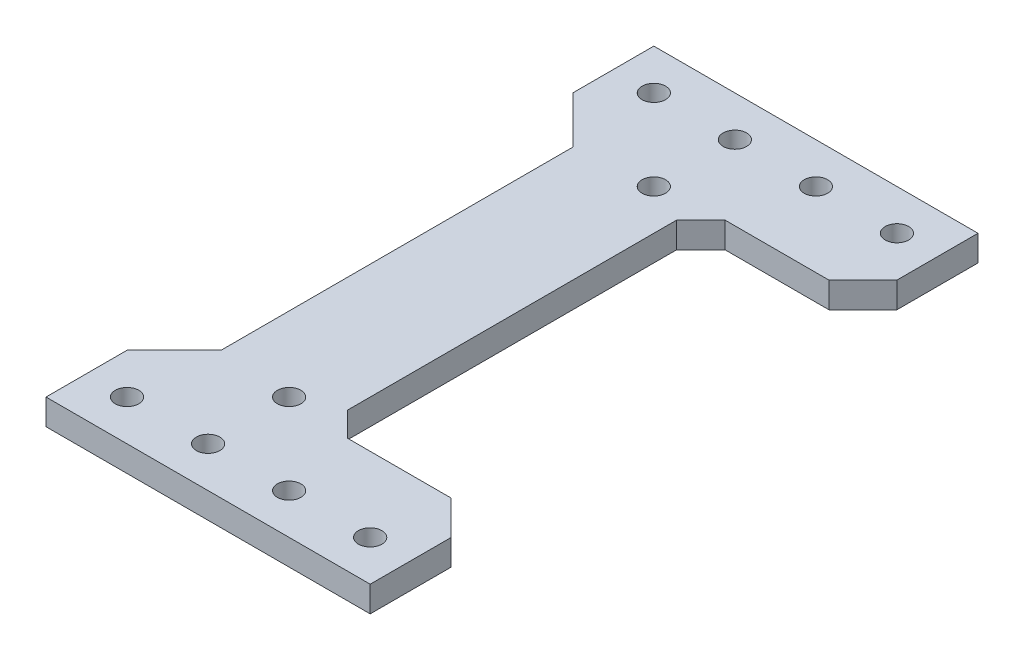
ISO-10303-21;
HEADER;
FILE_DESCRIPTION(('STEP AP214'),'2;1');
FILE_NAME('part.step','',(''),(''),'','','');
FILE_SCHEMA(('AUTOMOTIVE_DESIGN { 1 0 10303 214 1 1 1 1 }'));
ENDSEC;
DATA;
#1=APPLICATION_CONTEXT('core data for automotive mechanical design processes');
#2=APPLICATION_PROTOCOL_DEFINITION('international standard','automotive_design',2000,#1);
#3=PRODUCT_CONTEXT('',#1,'mechanical');
#4=PRODUCT('Part','Part','',(#3));
#5=PRODUCT_RELATED_PRODUCT_CATEGORY('part','',(#4));
#6=PRODUCT_DEFINITION_FORMATION('','',#4);
#7=PRODUCT_DEFINITION_CONTEXT('part definition',#1,'design');
#8=PRODUCT_DEFINITION('design','',#6,#7);
#9=PRODUCT_DEFINITION_SHAPE('','',#8);
#10=(LENGTH_UNIT() NAMED_UNIT(*) SI_UNIT(.MILLI.,.METRE.));
#11=(NAMED_UNIT(*) PLANE_ANGLE_UNIT() SI_UNIT($,.RADIAN.));
#12=(NAMED_UNIT(*) SI_UNIT($,.STERADIAN.) SOLID_ANGLE_UNIT());
#13=UNCERTAINTY_MEASURE_WITH_UNIT(LENGTH_MEASURE(1.E-05),#10,'distance_accuracy_value','');
#14=(GEOMETRIC_REPRESENTATION_CONTEXT(3) GLOBAL_UNCERTAINTY_ASSIGNED_CONTEXT((#13)) GLOBAL_UNIT_ASSIGNED_CONTEXT((#10,
#11,#12)) REPRESENTATION_CONTEXT('',''));
#15=CARTESIAN_POINT('',(0.,0.,0.));
#16=DIRECTION('',(0.,0.,1.));
#17=DIRECTION('',(1.,0.,0.));
#18=AXIS2_PLACEMENT_3D('',#15,#16,#17);
#19=CARTESIAN_POINT('',(5.,3.175,-23.3));
#20=DIRECTION('',(0.,-1.,0.));
#21=DIRECTION('',(0.,0.,-1.));
#22=AXIS2_PLACEMENT_3D('',#19,#20,#21);
#23=PLANE('',#22);
#24=CARTESIAN_POINT('',(0.,3.175,-32.5));
#25=DIRECTION('',(0.,1.,0.));
#26=DIRECTION('',(0.,0.,1.));
#27=AXIS2_PLACEMENT_3D('',#24,#25,#26);
#28=CIRCLE('',#27,1.45);
#29=CARTESIAN_POINT('',(0.,3.175,-31.05));
#30=VERTEX_POINT('',#29);
#31=EDGE_CURVE('E208',#30,#30,#28,.T.);
#32=ORIENTED_EDGE('',*,*,#31,.F.);
#33=EDGE_LOOP('',(#32));
#34=FACE_BOUND('',#33,.T.);
#35=CARTESIAN_POINT('',(-10.,3.175,-32.5));
#36=DIRECTION('',(0.,1.,0.));
#37=DIRECTION('',(0.,0.,1.));
#38=AXIS2_PLACEMENT_3D('',#35,#36,#37);
#39=CIRCLE('',#38,1.45);
#40=CARTESIAN_POINT('',(-10.,3.175,-31.05));
#41=VERTEX_POINT('',#40);
#42=EDGE_CURVE('E220',#41,#41,#39,.T.);
#43=ORIENTED_EDGE('',*,*,#42,.F.);
#44=EDGE_LOOP('',(#43));
#45=FACE_BOUND('',#44,.T.);
#46=DIRECTION('',(0.,0.,1.));
#47=VECTOR('',#46,1.);
#48=CARTESIAN_POINT('',(25.,3.175,37.5));
#49=LINE('',#48,#47);
#50=CARTESIAN_POINT('',(25.,3.175,27.5));
#51=VERTEX_POINT('',#50);
#52=CARTESIAN_POINT('',(25.,3.175,37.5));
#53=VERTEX_POINT('',#52);
#54=EDGE_CURVE('E182',#51,#53,#49,.T.);
#55=ORIENTED_EDGE('',*,*,#54,.F.);
#56=DIRECTION('',(0.707106781186547,0.,0.707106781186548));
#57=VECTOR('',#56,1.);
#58=CARTESIAN_POINT('',(20.8,3.175,23.3));
#59=LINE('',#58,#57);
#60=CARTESIAN_POINT('',(20.8,3.175,23.3));
#61=VERTEX_POINT('',#60);
#62=EDGE_CURVE('E279',#51,#61,#59,.F.);
#63=ORIENTED_EDGE('',*,*,#62,.T.);
#64=DIRECTION('',(1.,0.,0.));
#65=VECTOR('',#64,1.);
#66=CARTESIAN_POINT('',(5.00000000000001,3.175,23.3));
#67=LINE('',#66,#65);
#68=CARTESIAN_POINT('',(8.,3.175,23.3));
#69=VERTEX_POINT('',#68);
#70=EDGE_CURVE('E184',#69,#61,#67,.T.);
#71=ORIENTED_EDGE('',*,*,#70,.F.);
#72=DIRECTION('',(-0.707106781186544,0.,-0.707106781186551));
#73=VECTOR('',#72,1.);
#74=CARTESIAN_POINT('',(-16.8,3.175,-1.50000000000021));
#75=LINE('',#74,#73);
#76=CARTESIAN_POINT('',(5.,3.175,20.3));
#77=VERTEX_POINT('',#76);
#78=EDGE_CURVE('E11',#69,#77,#75,.T.);
#79=ORIENTED_EDGE('',*,*,#78,.T.);
#80=DIRECTION('',(0.,0.,-1.));
#81=VECTOR('',#80,1.);
#82=CARTESIAN_POINT('',(5.,3.175,0.));
#83=LINE('',#82,#81);
#84=CARTESIAN_POINT('',(5.,3.175,-20.3));
#85=VERTEX_POINT('',#84);
#86=EDGE_CURVE('E232',#77,#85,#83,.T.);
#87=ORIENTED_EDGE('',*,*,#86,.T.);
#88=DIRECTION('',(-0.707106781186552,0.,0.707106781186543));
#89=VECTOR('',#88,1.);
#90=CARTESIAN_POINT('',(6.49999999999999,3.175,-21.8));
#91=LINE('',#90,#89);
#92=CARTESIAN_POINT('',(8.00000000000002,3.175,-23.3));
#93=VERTEX_POINT('',#92);
#94=EDGE_CURVE('E299',#85,#93,#91,.F.);
#95=ORIENTED_EDGE('',*,*,#94,.T.);
#96=DIRECTION('',(1.,0.,0.));
#97=VECTOR('',#96,1.);
#98=CARTESIAN_POINT('',(5.,3.175,-23.3));
#99=LINE('',#98,#97);
#100=CARTESIAN_POINT('',(20.8,3.175,-23.3));
#101=VERTEX_POINT('',#100);
#102=EDGE_CURVE('E235',#93,#101,#99,.T.);
#103=ORIENTED_EDGE('',*,*,#102,.T.);
#104=DIRECTION('',(-0.707106781186549,0.,0.707106781186546));
#105=VECTOR('',#104,1.);
#106=CARTESIAN_POINT('',(25.,3.175,-27.5));
#107=LINE('',#106,#105);
#108=CARTESIAN_POINT('',(25.,3.175,-27.5));
#109=VERTEX_POINT('',#108);
#110=EDGE_CURVE('E277',#101,#109,#107,.F.);
#111=ORIENTED_EDGE('',*,*,#110,.T.);
#112=DIRECTION('',(0.,0.,-1.));
#113=VECTOR('',#112,1.);
#114=CARTESIAN_POINT('',(25.,3.175,-37.5));
#115=LINE('',#114,#113);
#116=CARTESIAN_POINT('',(25.,3.175,-37.5));
#117=VERTEX_POINT('',#116);
#118=EDGE_CURVE('E237',#109,#117,#115,.T.);
#119=ORIENTED_EDGE('',*,*,#118,.T.);
#120=DIRECTION('',(-1.,0.,0.));
#121=VECTOR('',#120,1.);
#122=CARTESIAN_POINT('',(-15.,3.175,-37.5));
#123=LINE('',#122,#121);
#124=CARTESIAN_POINT('',(-15.,3.175,-37.5));
#125=VERTEX_POINT('',#124);
#126=EDGE_CURVE('E239',#117,#125,#123,.T.);
#127=ORIENTED_EDGE('',*,*,#126,.T.);
#128=DIRECTION('',(0.,0.,1.));
#129=VECTOR('',#128,1.);
#130=CARTESIAN_POINT('',(-15.,3.175,-37.5));
#131=LINE('',#130,#129);
#132=CARTESIAN_POINT('',(-15.,3.175,-27.5));
#133=VERTEX_POINT('',#132);
#134=EDGE_CURVE('E241',#125,#133,#131,.T.);
#135=ORIENTED_EDGE('',*,*,#134,.T.);
#136=DIRECTION('',(0.707106781186549,0.,0.707106781186546));
#137=VECTOR('',#136,1.);
#138=CARTESIAN_POINT('',(-15.,3.175,-27.5));
#139=LINE('',#138,#137);
#140=CARTESIAN_POINT('',(-9.2,3.175,-21.7));
#141=VERTEX_POINT('',#140);
#142=EDGE_CURVE('E151',#133,#141,#139,.T.);
#143=ORIENTED_EDGE('',*,*,#142,.T.);
#144=DIRECTION('',(0.,0.,1.));
#145=VECTOR('',#144,1.);
#146=CARTESIAN_POINT('',(-9.2,3.175,0.));
#147=LINE('',#146,#145);
#148=CARTESIAN_POINT('',(-9.19999999999999,3.175,21.7));
#149=VERTEX_POINT('',#148);
#150=EDGE_CURVE('E142',#141,#149,#147,.T.);
#151=ORIENTED_EDGE('',*,*,#150,.T.);
#152=DIRECTION('',(0.707106781186549,0.,-0.707106781186546));
#153=VECTOR('',#152,1.);
#154=CARTESIAN_POINT('',(-15.,3.175,27.5));
#155=LINE('',#154,#153);
#156=CARTESIAN_POINT('',(-15.,3.175,27.5));
#157=VERTEX_POINT('',#156);
#158=EDGE_CURVE('E148',#157,#149,#155,.T.);
#159=ORIENTED_EDGE('',*,*,#158,.F.);
#160=DIRECTION('',(0.,0.,-1.));
#161=VECTOR('',#160,1.);
#162=CARTESIAN_POINT('',(-15.,3.175,37.5));
#163=LINE('',#162,#161);
#164=CARTESIAN_POINT('',(-15.,3.175,37.5));
#165=VERTEX_POINT('',#164);
#166=EDGE_CURVE('E169',#165,#157,#163,.T.);
#167=ORIENTED_EDGE('',*,*,#166,.F.);
#168=DIRECTION('',(-1.,0.,0.));
#169=VECTOR('',#168,1.);
#170=CARTESIAN_POINT('',(-15.,3.175,37.5));
#171=LINE('',#170,#169);
#172=EDGE_CURVE('E172',#53,#165,#171,.T.);
#173=ORIENTED_EDGE('',*,*,#172,.F.);
#174=EDGE_LOOP('',(#55,#63,#71,#79,#87,#95,#103,#111,#119,#127,#135,#143,#151,#159,#167,#173));
#175=FACE_BOUND('',#174,.T.);
#176=CARTESIAN_POINT('',(0.,3.175,-22.5));
#177=DIRECTION('',(0.,1.,0.));
#178=DIRECTION('',(0.,0.,1.));
#179=AXIS2_PLACEMENT_3D('',#176,#177,#178);
#180=CIRCLE('',#179,1.45);
#181=CARTESIAN_POINT('',(0.,3.175,-21.05));
#182=VERTEX_POINT('',#181);
#183=EDGE_CURVE('E226',#182,#182,#180,.T.);
#184=ORIENTED_EDGE('',*,*,#183,.F.);
#185=EDGE_LOOP('',(#184));
#186=FACE_BOUND('',#185,.T.);
#187=CARTESIAN_POINT('',(20.,3.175,-32.5));
#188=DIRECTION('',(0.,1.,0.));
#189=DIRECTION('',(0.,0.,1.));
#190=AXIS2_PLACEMENT_3D('',#187,#188,#189);
#191=CIRCLE('',#190,1.45);
#192=CARTESIAN_POINT('',(20.,3.175,-31.05));
#193=VERTEX_POINT('',#192);
#194=EDGE_CURVE('E214',#193,#193,#191,.T.);
#195=ORIENTED_EDGE('',*,*,#194,.F.);
#196=EDGE_LOOP('',(#195));
#197=FACE_BOUND('',#196,.T.);
#198=CARTESIAN_POINT('',(10.,3.175,-32.5));
#199=DIRECTION('',(0.,1.,0.));
#200=DIRECTION('',(0.,0.,1.));
#201=AXIS2_PLACEMENT_3D('',#198,#199,#200);
#202=CIRCLE('',#201,1.45);
#203=CARTESIAN_POINT('',(10.,3.175,-31.05));
#204=VERTEX_POINT('',#203);
#205=EDGE_CURVE('E202',#204,#204,#202,.T.);
#206=ORIENTED_EDGE('',*,*,#205,.F.);
#207=EDGE_LOOP('',(#206));
#208=FACE_BOUND('',#207,.T.);
#209=CARTESIAN_POINT('',(10.,3.175,32.5));
#210=DIRECTION('',(0.,-1.,0.));
#211=DIRECTION('',(0.,0.,-1.));
#212=AXIS2_PLACEMENT_3D('',#209,#210,#211);
#213=CIRCLE('',#212,1.45);
#214=CARTESIAN_POINT('',(10.,3.175,31.05));
#215=VERTEX_POINT('',#214);
#216=EDGE_CURVE('E640',#215,#215,#213,.T.);
#217=ORIENTED_EDGE('',*,*,#216,.T.);
#218=EDGE_LOOP('',(#217));
#219=FACE_BOUND('',#218,.T.);
#220=CARTESIAN_POINT('',(0.,3.175,32.5));
#221=DIRECTION('',(0.,-1.,0.));
#222=DIRECTION('',(0.,0.,-1.));
#223=AXIS2_PLACEMENT_3D('',#220,#221,#222);
#224=CIRCLE('',#223,1.45);
#225=CARTESIAN_POINT('',(0.,3.175,31.05));
#226=VERTEX_POINT('',#225);
#227=EDGE_CURVE('E636',#226,#226,#224,.T.);
#228=ORIENTED_EDGE('',*,*,#227,.T.);
#229=EDGE_LOOP('',(#228));
#230=FACE_BOUND('',#229,.T.);
#231=CARTESIAN_POINT('',(20.,3.175,32.5));
#232=DIRECTION('',(0.,-1.,0.));
#233=DIRECTION('',(0.,0.,-1.));
#234=AXIS2_PLACEMENT_3D('',#231,#232,#233);
#235=CIRCLE('',#234,1.45);
#236=CARTESIAN_POINT('',(20.,3.175,31.05));
#237=VERTEX_POINT('',#236);
#238=EDGE_CURVE('E632',#237,#237,#235,.T.);
#239=ORIENTED_EDGE('',*,*,#238,.T.);
#240=EDGE_LOOP('',(#239));
#241=FACE_BOUND('',#240,.T.);
#242=CARTESIAN_POINT('',(-9.99999999999999,3.175,32.5));
#243=DIRECTION('',(0.,-1.,0.));
#244=DIRECTION('',(0.,0.,-1.));
#245=AXIS2_PLACEMENT_3D('',#242,#243,#244);
#246=CIRCLE('',#245,1.45);
#247=CARTESIAN_POINT('',(-9.99999999999999,3.175,31.05));
#248=VERTEX_POINT('',#247);
#249=EDGE_CURVE('E626',#248,#248,#246,.T.);
#250=ORIENTED_EDGE('',*,*,#249,.T.);
#251=EDGE_LOOP('',(#250));
#252=FACE_BOUND('',#251,.T.);
#253=CARTESIAN_POINT('',(0.,3.175,22.5));
#254=DIRECTION('',(0.,-1.,0.));
#255=DIRECTION('',(0.,0.,-1.));
#256=AXIS2_PLACEMENT_3D('',#253,#254,#255);
#257=CIRCLE('',#256,1.45);
#258=CARTESIAN_POINT('',(0.,3.175,21.05));
#259=VERTEX_POINT('',#258);
#260=EDGE_CURVE('E190',#259,#259,#257,.T.);
#261=ORIENTED_EDGE('',*,*,#260,.T.);
#262=EDGE_LOOP('',(#261));
#263=FACE_BOUND('',#262,.T.);
#264=ADVANCED_FACE('F31',(#34,#45,#175,#186,#197,#208,#219,#230,#241,#252,#263),#23,.F.);
#265=CARTESIAN_POINT('',(5.,0.,-23.3));
#266=DIRECTION('',(0.,-1.,0.));
#267=DIRECTION('',(0.,0.,-1.));
#268=AXIS2_PLACEMENT_3D('',#265,#266,#267);
#269=PLANE('',#268);
#270=CARTESIAN_POINT('',(0.,0.,-32.5));
#271=DIRECTION('',(0.,1.,0.));
#272=DIRECTION('',(0.,0.,1.));
#273=AXIS2_PLACEMENT_3D('',#270,#271,#272);
#274=CIRCLE('',#273,1.45);
#275=CARTESIAN_POINT('',(0.,0.,-31.05));
#276=VERTEX_POINT('',#275);
#277=EDGE_CURVE('E205',#276,#276,#274,.T.);
#278=ORIENTED_EDGE('',*,*,#277,.T.);
#279=EDGE_LOOP('',(#278));
#280=FACE_BOUND('',#279,.T.);
#281=CARTESIAN_POINT('',(-10.,0.,-32.5));
#282=DIRECTION('',(0.,1.,0.));
#283=DIRECTION('',(0.,0.,1.));
#284=AXIS2_PLACEMENT_3D('',#281,#282,#283);
#285=CIRCLE('',#284,1.45);
#286=CARTESIAN_POINT('',(-10.,0.,-31.05));
#287=VERTEX_POINT('',#286);
#288=EDGE_CURVE('E217',#287,#287,#285,.T.);
#289=ORIENTED_EDGE('',*,*,#288,.T.);
#290=EDGE_LOOP('',(#289));
#291=FACE_BOUND('',#290,.T.);
#292=DIRECTION('',(0.,0.,-1.));
#293=VECTOR('',#292,1.);
#294=CARTESIAN_POINT('',(5.,0.,0.));
#295=LINE('',#294,#293);
#296=CARTESIAN_POINT('',(5.,0.,20.3));
#297=VERTEX_POINT('',#296);
#298=CARTESIAN_POINT('',(5.,0.,-20.3));
#299=VERTEX_POINT('',#298);
#300=EDGE_CURVE('E229',#297,#299,#295,.T.);
#301=ORIENTED_EDGE('',*,*,#300,.F.);
#302=DIRECTION('',(0.707106781186544,0.,0.707106781186551));
#303=VECTOR('',#302,1.);
#304=CARTESIAN_POINT('',(5.,0.,20.3));
#305=LINE('',#304,#303);
#306=CARTESIAN_POINT('',(8.,0.,23.3));
#307=VERTEX_POINT('',#306);
#308=EDGE_CURVE('E39',#297,#307,#305,.T.);
#309=ORIENTED_EDGE('',*,*,#308,.T.);
#310=DIRECTION('',(1.,0.,0.));
#311=VECTOR('',#310,1.);
#312=CARTESIAN_POINT('',(5.00000000000001,0.,23.3));
#313=LINE('',#312,#311);
#314=CARTESIAN_POINT('',(20.8,0.,23.3));
#315=VERTEX_POINT('',#314);
#316=EDGE_CURVE('E170',#307,#315,#313,.T.);
#317=ORIENTED_EDGE('',*,*,#316,.T.);
#318=DIRECTION('',(-0.707106781186547,0.,-0.707106781186548));
#319=VECTOR('',#318,1.);
#320=CARTESIAN_POINT('',(-10.4,0.,-7.90000000000002));
#321=LINE('',#320,#319);
#322=CARTESIAN_POINT('',(25.,0.,27.5));
#323=VERTEX_POINT('',#322);
#324=EDGE_CURVE('E273',#315,#323,#321,.F.);
#325=ORIENTED_EDGE('',*,*,#324,.T.);
#326=DIRECTION('',(0.,0.,1.));
#327=VECTOR('',#326,1.);
#328=CARTESIAN_POINT('',(25.,0.,37.5));
#329=LINE('',#328,#327);
#330=CARTESIAN_POINT('',(25.,0.,37.5));
#331=VERTEX_POINT('',#330);
#332=EDGE_CURVE('E174',#323,#331,#329,.T.);
#333=ORIENTED_EDGE('',*,*,#332,.T.);
#334=DIRECTION('',(-1.,0.,0.));
#335=VECTOR('',#334,1.);
#336=CARTESIAN_POINT('',(-15.,0.,37.5));
#337=LINE('',#336,#335);
#338=CARTESIAN_POINT('',(-15.,0.,37.5));
#339=VERTEX_POINT('',#338);
#340=EDGE_CURVE('E193',#331,#339,#337,.T.);
#341=ORIENTED_EDGE('',*,*,#340,.T.);
#342=DIRECTION('',(0.,0.,-1.));
#343=VECTOR('',#342,1.);
#344=CARTESIAN_POINT('',(-15.,0.,37.5));
#345=LINE('',#344,#343);
#346=CARTESIAN_POINT('',(-15.,0.,27.5));
#347=VERTEX_POINT('',#346);
#348=EDGE_CURVE('E189',#339,#347,#345,.T.);
#349=ORIENTED_EDGE('',*,*,#348,.T.);
#350=DIRECTION('',(0.707106781186549,0.,-0.707106781186546));
#351=VECTOR('',#350,1.);
#352=CARTESIAN_POINT('',(-15.,0.,27.5));
#353=LINE('',#352,#351);
#354=CARTESIAN_POINT('',(-9.19999999999999,0.,21.7));
#355=VERTEX_POINT('',#354);
#356=EDGE_CURVE('E187',#347,#355,#353,.T.);
#357=ORIENTED_EDGE('',*,*,#356,.T.);
#358=DIRECTION('',(0.,0.,1.));
#359=VECTOR('',#358,1.);
#360=CARTESIAN_POINT('',(-9.2,0.,0.));
#361=LINE('',#360,#359);
#362=CARTESIAN_POINT('',(-9.2,0.,-21.7));
#363=VERTEX_POINT('',#362);
#364=EDGE_CURVE('E161',#363,#355,#361,.T.);
#365=ORIENTED_EDGE('',*,*,#364,.F.);
#366=DIRECTION('',(0.707106781186549,0.,0.707106781186546));
#367=VECTOR('',#366,1.);
#368=CARTESIAN_POINT('',(-15.,0.,-27.5));
#369=LINE('',#368,#367);
#370=CARTESIAN_POINT('',(-15.,0.,-27.5));
#371=VERTEX_POINT('',#370);
#372=EDGE_CURVE('E254',#371,#363,#369,.T.);
#373=ORIENTED_EDGE('',*,*,#372,.F.);
#374=DIRECTION('',(0.,0.,1.));
#375=VECTOR('',#374,1.);
#376=CARTESIAN_POINT('',(-15.,0.,-37.5));
#377=LINE('',#376,#375);
#378=CARTESIAN_POINT('',(-15.,0.,-37.5));
#379=VERTEX_POINT('',#378);
#380=EDGE_CURVE('E252',#379,#371,#377,.T.);
#381=ORIENTED_EDGE('',*,*,#380,.F.);
#382=DIRECTION('',(-1.,0.,0.));
#383=VECTOR('',#382,1.);
#384=CARTESIAN_POINT('',(-15.,0.,-37.5));
#385=LINE('',#384,#383);
#386=CARTESIAN_POINT('',(25.,0.,-37.5));
#387=VERTEX_POINT('',#386);
#388=EDGE_CURVE('E250',#387,#379,#385,.T.);
#389=ORIENTED_EDGE('',*,*,#388,.F.);
#390=DIRECTION('',(0.,0.,-1.));
#391=VECTOR('',#390,1.);
#392=CARTESIAN_POINT('',(25.,0.,-37.5));
#393=LINE('',#392,#391);
#394=CARTESIAN_POINT('',(25.,0.,-27.5));
#395=VERTEX_POINT('',#394);
#396=EDGE_CURVE('E248',#395,#387,#393,.T.);
#397=ORIENTED_EDGE('',*,*,#396,.F.);
#398=DIRECTION('',(0.707106781186549,0.,-0.707106781186546));
#399=VECTOR('',#398,1.);
#400=CARTESIAN_POINT('',(12.9,0.,-15.4));
#401=LINE('',#400,#399);
#402=CARTESIAN_POINT('',(20.8,0.,-23.3));
#403=VERTEX_POINT('',#402);
#404=EDGE_CURVE('E270',#395,#403,#401,.F.);
#405=ORIENTED_EDGE('',*,*,#404,.T.);
#406=DIRECTION('',(1.,0.,0.));
#407=VECTOR('',#406,1.);
#408=CARTESIAN_POINT('',(5.,0.,-23.3));
#409=LINE('',#408,#407);
#410=CARTESIAN_POINT('',(8.00000000000002,0.,-23.3));
#411=VERTEX_POINT('',#410);
#412=EDGE_CURVE('E246',#411,#403,#409,.T.);
#413=ORIENTED_EDGE('',*,*,#412,.F.);
#414=DIRECTION('',(0.707106781186552,0.,-0.707106781186543));
#415=VECTOR('',#414,1.);
#416=CARTESIAN_POINT('',(8.00000000000002,0.,-23.3));
#417=LINE('',#416,#415);
#418=EDGE_CURVE('E297',#411,#299,#417,.F.);
#419=ORIENTED_EDGE('',*,*,#418,.T.);
#420=EDGE_LOOP('',(#301,#309,#317,#325,#333,#341,#349,#357,#365,#373,#381,#389,#397,#405,#413,#419));
#421=FACE_BOUND('',#420,.T.);
#422=CARTESIAN_POINT('',(0.,0.,-22.5));
#423=DIRECTION('',(0.,1.,0.));
#424=DIRECTION('',(0.,0.,1.));
#425=AXIS2_PLACEMENT_3D('',#422,#423,#424);
#426=CIRCLE('',#425,1.45);
#427=CARTESIAN_POINT('',(0.,0.,-21.05));
#428=VERTEX_POINT('',#427);
#429=EDGE_CURVE('E223',#428,#428,#426,.T.);
#430=ORIENTED_EDGE('',*,*,#429,.T.);
#431=EDGE_LOOP('',(#430));
#432=FACE_BOUND('',#431,.T.);
#433=CARTESIAN_POINT('',(20.,0.,-32.5));
#434=DIRECTION('',(0.,1.,0.));
#435=DIRECTION('',(0.,0.,1.));
#436=AXIS2_PLACEMENT_3D('',#433,#434,#435);
#437=CIRCLE('',#436,1.45);
#438=CARTESIAN_POINT('',(20.,0.,-31.05));
#439=VERTEX_POINT('',#438);
#440=EDGE_CURVE('E211',#439,#439,#437,.T.);
#441=ORIENTED_EDGE('',*,*,#440,.T.);
#442=EDGE_LOOP('',(#441));
#443=FACE_BOUND('',#442,.T.);
#444=CARTESIAN_POINT('',(10.,0.,-32.5));
#445=DIRECTION('',(0.,1.,0.));
#446=DIRECTION('',(0.,0.,1.));
#447=AXIS2_PLACEMENT_3D('',#444,#445,#446);
#448=CIRCLE('',#447,1.45);
#449=CARTESIAN_POINT('',(10.,0.,-31.05));
#450=VERTEX_POINT('',#449);
#451=EDGE_CURVE('E165',#450,#450,#448,.T.);
#452=ORIENTED_EDGE('',*,*,#451,.T.);
#453=EDGE_LOOP('',(#452));
#454=FACE_BOUND('',#453,.T.);
#455=CARTESIAN_POINT('',(10.,0.,32.5));
#456=DIRECTION('',(0.,-1.,0.));
#457=DIRECTION('',(0.,0.,-1.));
#458=AXIS2_PLACEMENT_3D('',#455,#456,#457);
#459=CIRCLE('',#458,1.45);
#460=CARTESIAN_POINT('',(10.,0.,31.05));
#461=VERTEX_POINT('',#460);
#462=EDGE_CURVE('E610',#461,#461,#459,.T.);
#463=ORIENTED_EDGE('',*,*,#462,.F.);
#464=EDGE_LOOP('',(#463));
#465=FACE_BOUND('',#464,.T.);
#466=CARTESIAN_POINT('',(0.,0.,32.5));
#467=DIRECTION('',(0.,-1.,0.));
#468=DIRECTION('',(0.,0.,-1.));
#469=AXIS2_PLACEMENT_3D('',#466,#467,#468);
#470=CIRCLE('',#469,1.45);
#471=CARTESIAN_POINT('',(0.,0.,31.05));
#472=VERTEX_POINT('',#471);
#473=EDGE_CURVE('E614',#472,#472,#470,.T.);
#474=ORIENTED_EDGE('',*,*,#473,.F.);
#475=EDGE_LOOP('',(#474));
#476=FACE_BOUND('',#475,.T.);
#477=CARTESIAN_POINT('',(20.,0.,32.5));
#478=DIRECTION('',(0.,-1.,0.));
#479=DIRECTION('',(0.,0.,-1.));
#480=AXIS2_PLACEMENT_3D('',#477,#478,#479);
#481=CIRCLE('',#480,1.45);
#482=CARTESIAN_POINT('',(20.,0.,31.05));
#483=VERTEX_POINT('',#482);
#484=EDGE_CURVE('E618',#483,#483,#481,.T.);
#485=ORIENTED_EDGE('',*,*,#484,.F.);
#486=EDGE_LOOP('',(#485));
#487=FACE_BOUND('',#486,.T.);
#488=CARTESIAN_POINT('',(-9.99999999999999,0.,32.5));
#489=DIRECTION('',(0.,-1.,0.));
#490=DIRECTION('',(0.,0.,-1.));
#491=AXIS2_PLACEMENT_3D('',#488,#489,#490);
#492=CIRCLE('',#491,1.45);
#493=CARTESIAN_POINT('',(-9.99999999999999,0.,31.05));
#494=VERTEX_POINT('',#493);
#495=EDGE_CURVE('E622',#494,#494,#492,.T.);
#496=ORIENTED_EDGE('',*,*,#495,.F.);
#497=EDGE_LOOP('',(#496));
#498=FACE_BOUND('',#497,.T.);
#499=CARTESIAN_POINT('',(0.,0.,22.5));
#500=DIRECTION('',(0.,-1.,0.));
#501=DIRECTION('',(0.,0.,-1.));
#502=AXIS2_PLACEMENT_3D('',#499,#500,#501);
#503=CIRCLE('',#502,1.45);
#504=CARTESIAN_POINT('',(0.,0.,21.05));
#505=VERTEX_POINT('',#504);
#506=EDGE_CURVE('E177',#505,#505,#503,.T.);
#507=ORIENTED_EDGE('',*,*,#506,.F.);
#508=EDGE_LOOP('',(#507));
#509=FACE_BOUND('',#508,.T.);
#510=ADVANCED_FACE('F312',(#280,#291,#421,#432,#443,#454,#465,#476,#487,#498,#509),#269,.T.);
#511=CARTESIAN_POINT('',(5.,3.175,0.));
#512=DIRECTION('',(-1.,0.,0.));
#513=DIRECTION('',(0.,0.,1.));
#514=AXIS2_PLACEMENT_3D('',#511,#512,#513);
#515=PLANE('',#514);
#516=ORIENTED_EDGE('',*,*,#300,.T.);
#517=DIRECTION('',(0.,1.,0.));
#518=VECTOR('',#517,1.);
#519=CARTESIAN_POINT('',(5.,3.175,-20.3));
#520=LINE('',#519,#518);
#521=EDGE_CURVE('E294',#299,#85,#520,.T.);
#522=ORIENTED_EDGE('',*,*,#521,.T.);
#523=ORIENTED_EDGE('',*,*,#86,.F.);
#524=DIRECTION('',(0.,-1.,0.));
#525=VECTOR('',#524,1.);
#526=CARTESIAN_POINT('',(5.,3.175,20.3));
#527=LINE('',#526,#525);
#528=EDGE_CURVE('E291',#77,#297,#527,.T.);
#529=ORIENTED_EDGE('',*,*,#528,.T.);
#530=EDGE_LOOP('',(#516,#522,#523,#529));
#531=FACE_BOUND('',#530,.T.);
#532=ADVANCED_FACE('F315',(#531),#515,.F.);
#533=CARTESIAN_POINT('',(5.,3.175,-23.3));
#534=DIRECTION('',(0.,0.,-1.));
#535=DIRECTION('',(-1.,0.,0.));
#536=AXIS2_PLACEMENT_3D('',#533,#534,#535);
#537=PLANE('',#536);
#538=ORIENTED_EDGE('',*,*,#102,.F.);
#539=DIRECTION('',(0.,-1.,0.));
#540=VECTOR('',#539,1.);
#541=CARTESIAN_POINT('',(8.00000000000002,0.,-23.3));
#542=LINE('',#541,#540);
#543=EDGE_CURVE('E288',#93,#411,#542,.T.);
#544=ORIENTED_EDGE('',*,*,#543,.T.);
#545=ORIENTED_EDGE('',*,*,#412,.T.);
#546=DIRECTION('',(0.,1.,0.));
#547=VECTOR('',#546,1.);
#548=CARTESIAN_POINT('',(20.8,3.175,-23.3));
#549=LINE('',#548,#547);
#550=EDGE_CURVE('E285',#403,#101,#549,.T.);
#551=ORIENTED_EDGE('',*,*,#550,.T.);
#552=EDGE_LOOP('',(#538,#544,#545,#551));
#553=FACE_BOUND('',#552,.T.);
#554=ADVANCED_FACE('F307',(#553),#537,.F.);
#555=CARTESIAN_POINT('',(25.,3.175,-37.5));
#556=DIRECTION('',(-1.,0.,0.));
#557=DIRECTION('',(0.,0.,1.));
#558=AXIS2_PLACEMENT_3D('',#555,#556,#557);
#559=PLANE('',#558);
#560=ORIENTED_EDGE('',*,*,#118,.F.);
#561=DIRECTION('',(0.,-1.,0.));
#562=VECTOR('',#561,1.);
#563=CARTESIAN_POINT('',(25.,3.175,-27.5));
#564=LINE('',#563,#562);
#565=EDGE_CURVE('E282',#109,#395,#564,.T.);
#566=ORIENTED_EDGE('',*,*,#565,.T.);
#567=ORIENTED_EDGE('',*,*,#396,.T.);
#568=DIRECTION('',(0.,-1.,0.));
#569=VECTOR('',#568,1.);
#570=CARTESIAN_POINT('',(25.,3.175,-37.5));
#571=LINE('',#570,#569);
#572=EDGE_CURVE('E264',#117,#387,#571,.T.);
#573=ORIENTED_EDGE('',*,*,#572,.F.);
#574=EDGE_LOOP('',(#560,#566,#567,#573));
#575=FACE_BOUND('',#574,.T.);
#576=ADVANCED_FACE('F373',(#575),#559,.F.);
#577=CARTESIAN_POINT('',(-15.,3.175,-37.5));
#578=DIRECTION('',(0.,0.,1.));
#579=DIRECTION('',(1.,0.,0.));
#580=AXIS2_PLACEMENT_3D('',#577,#578,#579);
#581=PLANE('',#580);
#582=ORIENTED_EDGE('',*,*,#388,.T.);
#583=DIRECTION('',(0.,-1.,0.));
#584=VECTOR('',#583,1.);
#585=CARTESIAN_POINT('',(-15.,3.175,-37.5));
#586=LINE('',#585,#584);
#587=EDGE_CURVE('E261',#125,#379,#586,.T.);
#588=ORIENTED_EDGE('',*,*,#587,.F.);
#589=ORIENTED_EDGE('',*,*,#126,.F.);
#590=ORIENTED_EDGE('',*,*,#572,.T.);
#591=EDGE_LOOP('',(#582,#588,#589,#590));
#592=FACE_BOUND('',#591,.T.);
#593=ADVANCED_FACE('F369',(#592),#581,.F.);
#594=CARTESIAN_POINT('',(-15.,3.175,-37.5));
#595=DIRECTION('',(1.,0.,0.));
#596=DIRECTION('',(0.,0.,-1.));
#597=AXIS2_PLACEMENT_3D('',#594,#595,#596);
#598=PLANE('',#597);
#599=ORIENTED_EDGE('',*,*,#380,.T.);
#600=DIRECTION('',(0.,-1.,0.));
#601=VECTOR('',#600,1.);
#602=CARTESIAN_POINT('',(-15.,3.175,-27.5));
#603=LINE('',#602,#601);
#604=EDGE_CURVE('E258',#133,#371,#603,.T.);
#605=ORIENTED_EDGE('',*,*,#604,.F.);
#606=ORIENTED_EDGE('',*,*,#134,.F.);
#607=ORIENTED_EDGE('',*,*,#587,.T.);
#608=EDGE_LOOP('',(#599,#605,#606,#607));
#609=FACE_BOUND('',#608,.T.);
#610=ADVANCED_FACE('F365',(#609),#598,.F.);
#611=CARTESIAN_POINT('',(-15.,3.175,-27.5));
#612=DIRECTION('',(0.707106781186546,0.,-0.707106781186549));
#613=DIRECTION('',(-0.707106781186549,0.,-0.707106781186546));
#614=AXIS2_PLACEMENT_3D('',#611,#612,#613);
#615=PLANE('',#614);
#616=ORIENTED_EDGE('',*,*,#372,.T.);
#617=DIRECTION('',(0.,-1.,0.));
#618=VECTOR('',#617,1.);
#619=CARTESIAN_POINT('',(-9.2,3.175,-21.7));
#620=LINE('',#619,#618);
#621=EDGE_CURVE('E155',#141,#363,#620,.T.);
#622=ORIENTED_EDGE('',*,*,#621,.F.);
#623=ORIENTED_EDGE('',*,*,#142,.F.);
#624=ORIENTED_EDGE('',*,*,#604,.T.);
#625=EDGE_LOOP('',(#616,#622,#623,#624));
#626=FACE_BOUND('',#625,.T.);
#627=ADVANCED_FACE('F362',(#626),#615,.F.);
#628=CARTESIAN_POINT('',(-9.2,3.175,0.));
#629=DIRECTION('',(1.,0.,0.));
#630=DIRECTION('',(0.,0.,-1.));
#631=AXIS2_PLACEMENT_3D('',#628,#629,#630);
#632=PLANE('',#631);
#633=ORIENTED_EDGE('',*,*,#364,.T.);
#634=DIRECTION('',(0.,-1.,0.));
#635=VECTOR('',#634,1.);
#636=CARTESIAN_POINT('',(-9.19999999999999,3.175,21.7));
#637=LINE('',#636,#635);
#638=EDGE_CURVE('E158',#149,#355,#637,.T.);
#639=ORIENTED_EDGE('',*,*,#638,.F.);
#640=ORIENTED_EDGE('',*,*,#150,.F.);
#641=ORIENTED_EDGE('',*,*,#621,.T.);
#642=EDGE_LOOP('',(#633,#639,#640,#641));
#643=FACE_BOUND('',#642,.T.);
#644=ADVANCED_FACE('F159',(#643),#632,.F.);
#645=CARTESIAN_POINT('',(0.,3.175,-22.5));
#646=DIRECTION('',(0.,-1.,0.));
#647=DIRECTION('',(0.,0.,-1.));
#648=AXIS2_PLACEMENT_3D('',#645,#646,#647);
#649=CYLINDRICAL_SURFACE('',#648,1.45);
#650=ORIENTED_EDGE('',*,*,#183,.T.);
#651=EDGE_LOOP('',(#650));
#652=FACE_BOUND('',#651,.T.);
#653=ORIENTED_EDGE('',*,*,#429,.F.);
#654=EDGE_LOOP('',(#653));
#655=FACE_BOUND('',#654,.T.);
#656=ADVANCED_FACE('F357',(#652,#655),#649,.F.);
#657=CARTESIAN_POINT('',(-10.,3.175,-32.5));
#658=DIRECTION('',(0.,-1.,0.));
#659=DIRECTION('',(0.,0.,-1.));
#660=AXIS2_PLACEMENT_3D('',#657,#658,#659);
#661=CYLINDRICAL_SURFACE('',#660,1.45);
#662=ORIENTED_EDGE('',*,*,#42,.T.);
#663=EDGE_LOOP('',(#662));
#664=FACE_BOUND('',#663,.T.);
#665=ORIENTED_EDGE('',*,*,#288,.F.);
#666=EDGE_LOOP('',(#665));
#667=FACE_BOUND('',#666,.T.);
#668=ADVANCED_FACE('F560',(#664,#667),#661,.F.);
#669=CARTESIAN_POINT('',(20.,3.175,-32.5));
#670=DIRECTION('',(0.,-1.,0.));
#671=DIRECTION('',(0.,0.,-1.));
#672=AXIS2_PLACEMENT_3D('',#669,#670,#671);
#673=CYLINDRICAL_SURFACE('',#672,1.45);
#674=ORIENTED_EDGE('',*,*,#194,.T.);
#675=EDGE_LOOP('',(#674));
#676=FACE_BOUND('',#675,.T.);
#677=ORIENTED_EDGE('',*,*,#440,.F.);
#678=EDGE_LOOP('',(#677));
#679=FACE_BOUND('',#678,.T.);
#680=ADVANCED_FACE('F550',(#676,#679),#673,.F.);
#681=CARTESIAN_POINT('',(0.,3.175,-32.5));
#682=DIRECTION('',(0.,-1.,0.));
#683=DIRECTION('',(0.,0.,-1.));
#684=AXIS2_PLACEMENT_3D('',#681,#682,#683);
#685=CYLINDRICAL_SURFACE('',#684,1.45);
#686=ORIENTED_EDGE('',*,*,#31,.T.);
#687=EDGE_LOOP('',(#686));
#688=FACE_BOUND('',#687,.T.);
#689=ORIENTED_EDGE('',*,*,#277,.F.);
#690=EDGE_LOOP('',(#689));
#691=FACE_BOUND('',#690,.T.);
#692=ADVANCED_FACE('F540',(#688,#691),#685,.F.);
#693=CARTESIAN_POINT('',(10.,3.175,-32.5));
#694=DIRECTION('',(0.,-1.,0.));
#695=DIRECTION('',(0.,0.,-1.));
#696=AXIS2_PLACEMENT_3D('',#693,#694,#695);
#697=CYLINDRICAL_SURFACE('',#696,1.45);
#698=ORIENTED_EDGE('',*,*,#205,.T.);
#699=EDGE_LOOP('',(#698));
#700=FACE_BOUND('',#699,.T.);
#701=ORIENTED_EDGE('',*,*,#451,.F.);
#702=EDGE_LOOP('',(#701));
#703=FACE_BOUND('',#702,.T.);
#704=ADVANCED_FACE('F344',(#700,#703),#697,.F.);
#705=CARTESIAN_POINT('',(-15.,3.175,27.5));
#706=DIRECTION('',(-0.707106781186546,0.,-0.707106781186549));
#707=DIRECTION('',(-0.707106781186549,0.,0.707106781186546));
#708=AXIS2_PLACEMENT_3D('',#705,#706,#707);
#709=PLANE('',#708);
#710=ORIENTED_EDGE('',*,*,#356,.F.);
#711=DIRECTION('',(0.,-1.,0.));
#712=VECTOR('',#711,1.);
#713=CARTESIAN_POINT('',(-15.,3.175,27.5));
#714=LINE('',#713,#712);
#715=EDGE_CURVE('E166',#157,#347,#714,.T.);
#716=ORIENTED_EDGE('',*,*,#715,.F.);
#717=ORIENTED_EDGE('',*,*,#158,.T.);
#718=ORIENTED_EDGE('',*,*,#638,.T.);
#719=EDGE_LOOP('',(#710,#716,#717,#718));
#720=FACE_BOUND('',#719,.T.);
#721=ADVANCED_FACE('F168',(#720),#709,.T.);
#722=CARTESIAN_POINT('',(-15.,3.175,37.5));
#723=DIRECTION('',(-1.,0.,0.));
#724=DIRECTION('',(0.,0.,1.));
#725=AXIS2_PLACEMENT_3D('',#722,#723,#724);
#726=PLANE('',#725);
#727=ORIENTED_EDGE('',*,*,#348,.F.);
#728=DIRECTION('',(0.,-1.,0.));
#729=VECTOR('',#728,1.);
#730=CARTESIAN_POINT('',(-15.,3.175,37.5));
#731=LINE('',#730,#729);
#732=EDGE_CURVE('E199',#165,#339,#731,.T.);
#733=ORIENTED_EDGE('',*,*,#732,.F.);
#734=ORIENTED_EDGE('',*,*,#166,.T.);
#735=ORIENTED_EDGE('',*,*,#715,.T.);
#736=EDGE_LOOP('',(#727,#733,#734,#735));
#737=FACE_BOUND('',#736,.T.);
#738=ADVANCED_FACE('F336',(#737),#726,.T.);
#739=CARTESIAN_POINT('',(-15.,3.175,37.5));
#740=DIRECTION('',(0.,0.,1.));
#741=DIRECTION('',(1.,0.,0.));
#742=AXIS2_PLACEMENT_3D('',#739,#740,#741);
#743=PLANE('',#742);
#744=ORIENTED_EDGE('',*,*,#340,.F.);
#745=DIRECTION('',(0.,-1.,0.));
#746=VECTOR('',#745,1.);
#747=CARTESIAN_POINT('',(25.,3.175,37.5));
#748=LINE('',#747,#746);
#749=EDGE_CURVE('E186',#53,#331,#748,.T.);
#750=ORIENTED_EDGE('',*,*,#749,.F.);
#751=ORIENTED_EDGE('',*,*,#172,.T.);
#752=ORIENTED_EDGE('',*,*,#732,.T.);
#753=EDGE_LOOP('',(#744,#750,#751,#752));
#754=FACE_BOUND('',#753,.T.);
#755=ADVANCED_FACE('F333',(#754),#743,.T.);
#756=CARTESIAN_POINT('',(25.,3.175,37.5));
#757=DIRECTION('',(1.,0.,0.));
#758=DIRECTION('',(0.,0.,-1.));
#759=AXIS2_PLACEMENT_3D('',#756,#757,#758);
#760=PLANE('',#759);
#761=ORIENTED_EDGE('',*,*,#332,.F.);
#762=DIRECTION('',(0.,1.,0.));
#763=VECTOR('',#762,1.);
#764=CARTESIAN_POINT('',(25.,3.175,27.5));
#765=LINE('',#764,#763);
#766=EDGE_CURVE('E275',#323,#51,#765,.T.);
#767=ORIENTED_EDGE('',*,*,#766,.T.);
#768=ORIENTED_EDGE('',*,*,#54,.T.);
#769=ORIENTED_EDGE('',*,*,#749,.T.);
#770=EDGE_LOOP('',(#761,#767,#768,#769));
#771=FACE_BOUND('',#770,.T.);
#772=ADVANCED_FACE('F328',(#771),#760,.T.);
#773=CARTESIAN_POINT('',(5.00000000000001,3.175,23.3));
#774=DIRECTION('',(0.,0.,-1.));
#775=DIRECTION('',(-1.,0.,0.));
#776=AXIS2_PLACEMENT_3D('',#773,#774,#775);
#777=PLANE('',#776);
#778=ORIENTED_EDGE('',*,*,#316,.F.);
#779=DIRECTION('',(0.,1.,0.));
#780=VECTOR('',#779,1.);
#781=CARTESIAN_POINT('',(8.,3.175,23.3));
#782=LINE('',#781,#780);
#783=EDGE_CURVE('E52',#307,#69,#782,.T.);
#784=ORIENTED_EDGE('',*,*,#783,.T.);
#785=ORIENTED_EDGE('',*,*,#70,.T.);
#786=DIRECTION('',(0.,-1.,0.));
#787=VECTOR('',#786,1.);
#788=CARTESIAN_POINT('',(20.8,3.175,23.3));
#789=LINE('',#788,#787);
#790=EDGE_CURVE('E267',#61,#315,#789,.T.);
#791=ORIENTED_EDGE('',*,*,#790,.T.);
#792=EDGE_LOOP('',(#778,#784,#785,#791));
#793=FACE_BOUND('',#792,.T.);
#794=ADVANCED_FACE('F321',(#793),#777,.T.);
#795=CARTESIAN_POINT('',(0.,3.175,22.5));
#796=DIRECTION('',(0.,-1.,0.));
#797=DIRECTION('',(0.,0.,-1.));
#798=AXIS2_PLACEMENT_3D('',#795,#796,#797);
#799=CYLINDRICAL_SURFACE('',#798,1.45);
#800=ORIENTED_EDGE('',*,*,#260,.F.);
#801=EDGE_LOOP('',(#800));
#802=FACE_BOUND('',#801,.T.);
#803=ORIENTED_EDGE('',*,*,#506,.T.);
#804=EDGE_LOOP('',(#803));
#805=FACE_BOUND('',#804,.T.);
#806=ADVANCED_FACE('F408',(#802,#805),#799,.F.);
#807=CARTESIAN_POINT('',(-9.99999999999999,3.175,32.5));
#808=DIRECTION('',(0.,-1.,0.));
#809=DIRECTION('',(0.,0.,-1.));
#810=AXIS2_PLACEMENT_3D('',#807,#808,#809);
#811=CYLINDRICAL_SURFACE('',#810,1.45);
#812=ORIENTED_EDGE('',*,*,#249,.F.);
#813=EDGE_LOOP('',(#812));
#814=FACE_BOUND('',#813,.T.);
#815=ORIENTED_EDGE('',*,*,#495,.T.);
#816=EDGE_LOOP('',(#815));
#817=FACE_BOUND('',#816,.T.);
#818=ADVANCED_FACE('F493',(#814,#817),#811,.F.);
#819=CARTESIAN_POINT('',(20.,3.175,32.5));
#820=DIRECTION('',(0.,-1.,0.));
#821=DIRECTION('',(0.,0.,-1.));
#822=AXIS2_PLACEMENT_3D('',#819,#820,#821);
#823=CYLINDRICAL_SURFACE('',#822,1.45);
#824=ORIENTED_EDGE('',*,*,#238,.F.);
#825=EDGE_LOOP('',(#824));
#826=FACE_BOUND('',#825,.T.);
#827=ORIENTED_EDGE('',*,*,#484,.T.);
#828=EDGE_LOOP('',(#827));
#829=FACE_BOUND('',#828,.T.);
#830=ADVANCED_FACE('F483',(#826,#829),#823,.F.);
#831=CARTESIAN_POINT('',(0.,3.175,32.5));
#832=DIRECTION('',(0.,-1.,0.));
#833=DIRECTION('',(0.,0.,-1.));
#834=AXIS2_PLACEMENT_3D('',#831,#832,#833);
#835=CYLINDRICAL_SURFACE('',#834,1.45);
#836=ORIENTED_EDGE('',*,*,#227,.F.);
#837=EDGE_LOOP('',(#836));
#838=FACE_BOUND('',#837,.T.);
#839=ORIENTED_EDGE('',*,*,#473,.T.);
#840=EDGE_LOOP('',(#839));
#841=FACE_BOUND('',#840,.T.);
#842=ADVANCED_FACE('F473',(#838,#841),#835,.F.);
#843=CARTESIAN_POINT('',(10.,3.175,32.5));
#844=DIRECTION('',(0.,-1.,0.));
#845=DIRECTION('',(0.,0.,-1.));
#846=AXIS2_PLACEMENT_3D('',#843,#844,#845);
#847=CYLINDRICAL_SURFACE('',#846,1.45);
#848=ORIENTED_EDGE('',*,*,#216,.F.);
#849=EDGE_LOOP('',(#848));
#850=FACE_BOUND('',#849,.T.);
#851=ORIENTED_EDGE('',*,*,#462,.T.);
#852=EDGE_LOOP('',(#851));
#853=FACE_BOUND('',#852,.T.);
#854=ADVANCED_FACE('F385',(#850,#853),#847,.F.);
#855=CARTESIAN_POINT('',(20.8,3.175,23.3));
#856=DIRECTION('',(-0.707106781186548,0.,0.707106781186547));
#857=DIRECTION('',(0.707106781186547,0.,0.707106781186548));
#858=AXIS2_PLACEMENT_3D('',#855,#856,#857);
#859=PLANE('',#858);
#860=ORIENTED_EDGE('',*,*,#62,.F.);
#861=ORIENTED_EDGE('',*,*,#766,.F.);
#862=ORIENTED_EDGE('',*,*,#324,.F.);
#863=ORIENTED_EDGE('',*,*,#790,.F.);
#864=EDGE_LOOP('',(#860,#861,#862,#863));
#865=FACE_BOUND('',#864,.T.);
#866=ADVANCED_FACE('F324',(#865),#859,.F.);
#867=CARTESIAN_POINT('',(25.,3.175,-27.5));
#868=DIRECTION('',(-0.707106781186546,0.,-0.707106781186549));
#869=DIRECTION('',(-0.707106781186549,0.,0.707106781186546));
#870=AXIS2_PLACEMENT_3D('',#867,#868,#869);
#871=PLANE('',#870);
#872=ORIENTED_EDGE('',*,*,#110,.F.);
#873=ORIENTED_EDGE('',*,*,#550,.F.);
#874=ORIENTED_EDGE('',*,*,#404,.F.);
#875=ORIENTED_EDGE('',*,*,#565,.F.);
#876=EDGE_LOOP('',(#872,#873,#874,#875));
#877=FACE_BOUND('',#876,.T.);
#878=ADVANCED_FACE('F384',(#877),#871,.F.);
#879=CARTESIAN_POINT('',(8.00000000000002,3.175,-23.3));
#880=DIRECTION('',(0.707106781186543,0.,0.707106781186552));
#881=DIRECTION('',(0.707106781186552,0.,-0.707106781186543));
#882=AXIS2_PLACEMENT_3D('',#879,#880,#881);
#883=PLANE('',#882);
#884=ORIENTED_EDGE('',*,*,#94,.F.);
#885=ORIENTED_EDGE('',*,*,#521,.F.);
#886=ORIENTED_EDGE('',*,*,#418,.F.);
#887=ORIENTED_EDGE('',*,*,#543,.F.);
#888=EDGE_LOOP('',(#884,#885,#886,#887));
#889=FACE_BOUND('',#888,.T.);
#890=ADVANCED_FACE('F311',(#889),#883,.T.);
#891=CARTESIAN_POINT('',(5.,3.175,20.3));
#892=DIRECTION('',(-0.707106781186551,0.,0.707106781186544));
#893=DIRECTION('',(0.707106781186544,0.,0.707106781186551));
#894=AXIS2_PLACEMENT_3D('',#891,#892,#893);
#895=PLANE('',#894);
#896=ORIENTED_EDGE('',*,*,#78,.F.);
#897=ORIENTED_EDGE('',*,*,#783,.F.);
#898=ORIENTED_EDGE('',*,*,#308,.F.);
#899=ORIENTED_EDGE('',*,*,#528,.F.);
#900=EDGE_LOOP('',(#896,#897,#898,#899));
#901=FACE_BOUND('',#900,.T.);
#902=ADVANCED_FACE('F33',(#901),#895,.F.);
#903=CLOSED_SHELL('',(#264,#510,#532,#554,#576,#593,#610,#627,#644,#656,#668,#680,#692,#704,
#721,#738,#755,#772,#794,#806,#818,#830,#842,#854,#866,#878,#890,#902));
#904=MANIFOLD_SOLID_BREP('B2',#903);
#905=ADVANCED_BREP_SHAPE_REPRESENTATION('',(#18,#904),#14);
#906=SHAPE_DEFINITION_REPRESENTATION(#9,#905);
ENDSEC;
END-ISO-10303-21;
